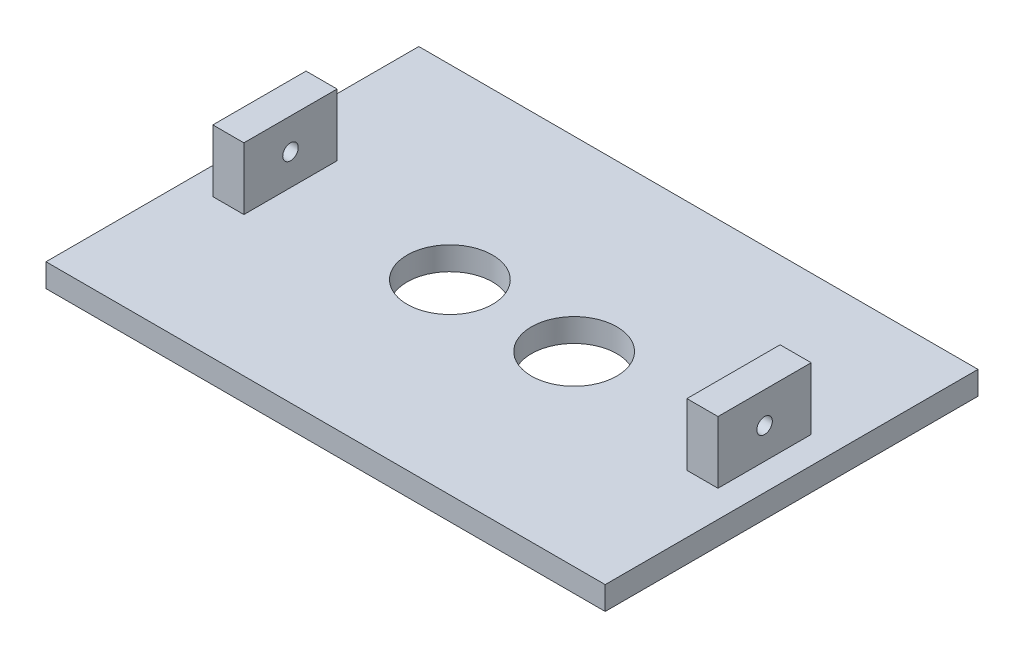
ISO-10303-21;
HEADER;
FILE_DESCRIPTION(('STEP AP214'),'2;1');
FILE_NAME('part.step','',(''),(''),'','','');
FILE_SCHEMA(('AUTOMOTIVE_DESIGN { 1 0 10303 214 1 1 1 1 }'));
ENDSEC;
DATA;
#1=APPLICATION_CONTEXT('core data for automotive mechanical design processes');
#2=APPLICATION_PROTOCOL_DEFINITION('international standard','automotive_design',2000,#1);
#3=PRODUCT_CONTEXT('',#1,'mechanical');
#4=PRODUCT('Part','Part','',(#3));
#5=PRODUCT_RELATED_PRODUCT_CATEGORY('part','',(#4));
#6=PRODUCT_DEFINITION_FORMATION('','',#4);
#7=PRODUCT_DEFINITION_CONTEXT('part definition',#1,'design');
#8=PRODUCT_DEFINITION('design','',#6,#7);
#9=PRODUCT_DEFINITION_SHAPE('','',#8);
#10=(LENGTH_UNIT() NAMED_UNIT(*) SI_UNIT(.MILLI.,.METRE.));
#11=(NAMED_UNIT(*) PLANE_ANGLE_UNIT() SI_UNIT($,.RADIAN.));
#12=(NAMED_UNIT(*) SI_UNIT($,.STERADIAN.) SOLID_ANGLE_UNIT());
#13=UNCERTAINTY_MEASURE_WITH_UNIT(LENGTH_MEASURE(1.E-05),#10,'distance_accuracy_value','');
#14=(GEOMETRIC_REPRESENTATION_CONTEXT(3) GLOBAL_UNCERTAINTY_ASSIGNED_CONTEXT((#13)) GLOBAL_UNIT_ASSIGNED_CONTEXT((#10,
#11,#12)) REPRESENTATION_CONTEXT('',''));
#15=CARTESIAN_POINT('',(0.,0.,0.));
#16=DIRECTION('',(0.,0.,1.));
#17=DIRECTION('',(1.,0.,0.));
#18=AXIS2_PLACEMENT_3D('',#15,#16,#17);
#19=CARTESIAN_POINT('',(0.,4.7625,0.));
#20=DIRECTION('',(0.,1.,0.));
#21=DIRECTION('',(0.,0.,1.));
#22=AXIS2_PLACEMENT_3D('',#19,#20,#21);
#23=PLANE('',#22);
#24=CARTESIAN_POINT('',(12.7,4.7625,0.));
#25=DIRECTION('',(0.,1.,0.));
#26=DIRECTION('',(0.,0.,1.));
#27=AXIS2_PLACEMENT_3D('',#24,#25,#26);
#28=CIRCLE('',#27,8.73125);
#29=CARTESIAN_POINT('',(12.7,4.7625,8.73125));
#30=VERTEX_POINT('',#29);
#31=EDGE_CURVE('E390',#30,#30,#28,.T.);
#32=ORIENTED_EDGE('',*,*,#31,.F.);
#33=EDGE_LOOP('',(#32));
#34=FACE_BOUND('',#33,.T.);
#35=CARTESIAN_POINT('',(-12.7,4.7625,0.));
#36=DIRECTION('',(0.,1.,0.));
#37=DIRECTION('',(0.,0.,1.));
#38=AXIS2_PLACEMENT_3D('',#35,#36,#37);
#39=CIRCLE('',#38,8.73125);
#40=CARTESIAN_POINT('',(-12.7,4.7625,8.73125));
#41=VERTEX_POINT('',#40);
#42=EDGE_CURVE('E394',#41,#41,#39,.T.);
#43=ORIENTED_EDGE('',*,*,#42,.F.);
#44=EDGE_LOOP('',(#43));
#45=FACE_BOUND('',#44,.T.);
#46=DIRECTION('',(0.,0.,-1.));
#47=VECTOR('',#46,1.);
#48=CARTESIAN_POINT('',(57.15,4.7625,-38.1));
#49=LINE('',#48,#47);
#50=CARTESIAN_POINT('',(57.15,4.7625,38.1));
#51=VERTEX_POINT('',#50);
#52=CARTESIAN_POINT('',(57.15,4.7625,-38.1));
#53=VERTEX_POINT('',#52);
#54=EDGE_CURVE('E185',#51,#53,#49,.T.);
#55=ORIENTED_EDGE('',*,*,#54,.T.);
#56=DIRECTION('',(-1.,0.,0.));
#57=VECTOR('',#56,1.);
#58=CARTESIAN_POINT('',(-57.15,4.7625,-38.1));
#59=LINE('',#58,#57);
#60=CARTESIAN_POINT('',(-57.15,4.7625,-38.1));
#61=VERTEX_POINT('',#60);
#62=EDGE_CURVE('E188',#53,#61,#59,.T.);
#63=ORIENTED_EDGE('',*,*,#62,.T.);
#64=DIRECTION('',(0.,0.,1.));
#65=VECTOR('',#64,1.);
#66=CARTESIAN_POINT('',(-57.15,4.7625,-38.1));
#67=LINE('',#66,#65);
#68=CARTESIAN_POINT('',(-57.15,4.7625,38.1));
#69=VERTEX_POINT('',#68);
#70=EDGE_CURVE('E191',#61,#69,#67,.T.);
#71=ORIENTED_EDGE('',*,*,#70,.T.);
#72=DIRECTION('',(1.,0.,0.));
#73=VECTOR('',#72,1.);
#74=CARTESIAN_POINT('',(-57.15,4.7625,38.1));
#75=LINE('',#74,#73);
#76=EDGE_CURVE('E193',#69,#51,#75,.T.);
#77=ORIENTED_EDGE('',*,*,#76,.T.);
#78=EDGE_LOOP('',(#55,#63,#71,#77));
#79=FACE_BOUND('',#78,.T.);
#80=DIRECTION('',(1.,0.,0.));
#81=VECTOR('',#80,1.);
#82=CARTESIAN_POINT('',(-45.2755,4.7625,9.52500000000001));
#83=LINE('',#82,#81);
#84=CARTESIAN_POINT('',(-51.6255,4.7625,9.52500000000001));
#85=VERTEX_POINT('',#84);
#86=CARTESIAN_POINT('',(-45.2755,4.7625,9.52500000000001));
#87=VERTEX_POINT('',#86);
#88=EDGE_CURVE('E156',#85,#87,#83,.T.);
#89=ORIENTED_EDGE('',*,*,#88,.F.);
#90=DIRECTION('',(0.,0.,1.));
#91=VECTOR('',#90,1.);
#92=CARTESIAN_POINT('',(-51.6255,4.7625,9.52500000000001));
#93=LINE('',#92,#91);
#94=CARTESIAN_POINT('',(-51.6255,4.7625,-9.52499999999999));
#95=VERTEX_POINT('',#94);
#96=EDGE_CURVE('E153',#95,#85,#93,.T.);
#97=ORIENTED_EDGE('',*,*,#96,.F.);
#98=DIRECTION('',(-1.,0.,0.));
#99=VECTOR('',#98,1.);
#100=CARTESIAN_POINT('',(-45.2755,4.7625,-9.52499999999999));
#101=LINE('',#100,#99);
#102=CARTESIAN_POINT('',(-45.2755,4.7625,-9.52499999999999));
#103=VERTEX_POINT('',#102);
#104=EDGE_CURVE('E165',#103,#95,#101,.T.);
#105=ORIENTED_EDGE('',*,*,#104,.F.);
#106=DIRECTION('',(0.,0.,-1.));
#107=VECTOR('',#106,1.);
#108=CARTESIAN_POINT('',(-45.2755,4.7625,9.52500000000001));
#109=LINE('',#108,#107);
#110=EDGE_CURVE('E173',#87,#103,#109,.T.);
#111=ORIENTED_EDGE('',*,*,#110,.F.);
#112=EDGE_LOOP('',(#89,#97,#105,#111));
#113=FACE_BOUND('',#112,.T.);
#114=DIRECTION('',(1.,0.,0.));
#115=VECTOR('',#114,1.);
#116=CARTESIAN_POINT('',(45.2755,4.7625,9.52500000000001));
#117=LINE('',#116,#115);
#118=CARTESIAN_POINT('',(45.2755,4.7625,9.52500000000001));
#119=VERTEX_POINT('',#118);
#120=CARTESIAN_POINT('',(51.6255,4.7625,9.52500000000001));
#121=VERTEX_POINT('',#120);
#122=EDGE_CURVE('E416',#119,#121,#117,.T.);
#123=ORIENTED_EDGE('',*,*,#122,.F.);
#124=DIRECTION('',(0.,0.,1.));
#125=VECTOR('',#124,1.);
#126=CARTESIAN_POINT('',(45.2755,4.7625,9.52500000000001));
#127=LINE('',#126,#125);
#128=CARTESIAN_POINT('',(45.2755,4.7625,-9.52499999999999));
#129=VERTEX_POINT('',#128);
#130=EDGE_CURVE('E151',#129,#119,#127,.T.);
#131=ORIENTED_EDGE('',*,*,#130,.F.);
#132=DIRECTION('',(-1.,0.,0.));
#133=VECTOR('',#132,1.);
#134=CARTESIAN_POINT('',(45.2755,4.7625,-9.52499999999999));
#135=LINE('',#134,#133);
#136=CARTESIAN_POINT('',(51.6255,4.7625,-9.52499999999999));
#137=VERTEX_POINT('',#136);
#138=EDGE_CURVE('E147',#137,#129,#135,.T.);
#139=ORIENTED_EDGE('',*,*,#138,.F.);
#140=DIRECTION('',(0.,0.,-1.));
#141=VECTOR('',#140,1.);
#142=CARTESIAN_POINT('',(51.6255,4.7625,9.52500000000001));
#143=LINE('',#142,#141);
#144=EDGE_CURVE('E418',#121,#137,#143,.T.);
#145=ORIENTED_EDGE('',*,*,#144,.F.);
#146=EDGE_LOOP('',(#123,#131,#139,#145));
#147=FACE_BOUND('',#146,.T.);
#148=ADVANCED_FACE('F37',(#34,#45,#79,#113,#147),#23,.T.);
#149=CARTESIAN_POINT('',(57.15,4.7625,-38.1));
#150=DIRECTION('',(-1.,0.,0.));
#151=DIRECTION('',(0.,0.,1.));
#152=AXIS2_PLACEMENT_3D('',#149,#150,#151);
#153=PLANE('',#152);
#154=DIRECTION('',(0.,0.,-1.));
#155=VECTOR('',#154,1.);
#156=CARTESIAN_POINT('',(57.15,0.,-38.1));
#157=LINE('',#156,#155);
#158=CARTESIAN_POINT('',(57.15,0.,38.1));
#159=VERTEX_POINT('',#158);
#160=CARTESIAN_POINT('',(57.15,0.,-38.1));
#161=VERTEX_POINT('',#160);
#162=EDGE_CURVE('E184',#159,#161,#157,.T.);
#163=ORIENTED_EDGE('',*,*,#162,.T.);
#164=DIRECTION('',(0.,-1.,0.));
#165=VECTOR('',#164,1.);
#166=CARTESIAN_POINT('',(57.15,4.7625,-38.1));
#167=LINE('',#166,#165);
#168=EDGE_CURVE('E11',#53,#161,#167,.T.);
#169=ORIENTED_EDGE('',*,*,#168,.F.);
#170=ORIENTED_EDGE('',*,*,#54,.F.);
#171=DIRECTION('',(0.,-1.,0.));
#172=VECTOR('',#171,1.);
#173=CARTESIAN_POINT('',(57.15,4.7625,38.1));
#174=LINE('',#173,#172);
#175=EDGE_CURVE('E195',#51,#159,#174,.T.);
#176=ORIENTED_EDGE('',*,*,#175,.T.);
#177=EDGE_LOOP('',(#163,#169,#170,#176));
#178=FACE_BOUND('',#177,.T.);
#179=ADVANCED_FACE('F39',(#178),#153,.F.);
#180=CARTESIAN_POINT('',(-57.15,4.7625,-38.1));
#181=DIRECTION('',(0.,0.,1.));
#182=DIRECTION('',(1.,0.,0.));
#183=AXIS2_PLACEMENT_3D('',#180,#181,#182);
#184=PLANE('',#183);
#185=DIRECTION('',(-1.,0.,0.));
#186=VECTOR('',#185,1.);
#187=CARTESIAN_POINT('',(-57.15,0.,-38.1));
#188=LINE('',#187,#186);
#189=CARTESIAN_POINT('',(-57.15,0.,-38.1));
#190=VERTEX_POINT('',#189);
#191=EDGE_CURVE('E198',#161,#190,#188,.T.);
#192=ORIENTED_EDGE('',*,*,#191,.T.);
#193=DIRECTION('',(0.,-1.,0.));
#194=VECTOR('',#193,1.);
#195=CARTESIAN_POINT('',(-57.15,4.7625,-38.1));
#196=LINE('',#195,#194);
#197=EDGE_CURVE('E46',#61,#190,#196,.T.);
#198=ORIENTED_EDGE('',*,*,#197,.F.);
#199=ORIENTED_EDGE('',*,*,#62,.F.);
#200=ORIENTED_EDGE('',*,*,#168,.T.);
#201=EDGE_LOOP('',(#192,#198,#199,#200));
#202=FACE_BOUND('',#201,.T.);
#203=ADVANCED_FACE('F229',(#202),#184,.F.);
#204=CARTESIAN_POINT('',(-57.15,4.7625,-38.1));
#205=DIRECTION('',(1.,0.,0.));
#206=DIRECTION('',(0.,0.,-1.));
#207=AXIS2_PLACEMENT_3D('',#204,#205,#206);
#208=PLANE('',#207);
#209=DIRECTION('',(0.,0.,1.));
#210=VECTOR('',#209,1.);
#211=CARTESIAN_POINT('',(-57.15,0.,-38.1));
#212=LINE('',#211,#210);
#213=CARTESIAN_POINT('',(-57.15,0.,38.1));
#214=VERTEX_POINT('',#213);
#215=EDGE_CURVE('E200',#190,#214,#212,.T.);
#216=ORIENTED_EDGE('',*,*,#215,.T.);
#217=DIRECTION('',(0.,-1.,0.));
#218=VECTOR('',#217,1.);
#219=CARTESIAN_POINT('',(-57.15,4.7625,38.1));
#220=LINE('',#219,#218);
#221=EDGE_CURVE('E205',#69,#214,#220,.T.);
#222=ORIENTED_EDGE('',*,*,#221,.F.);
#223=ORIENTED_EDGE('',*,*,#70,.F.);
#224=ORIENTED_EDGE('',*,*,#197,.T.);
#225=EDGE_LOOP('',(#216,#222,#223,#224));
#226=FACE_BOUND('',#225,.T.);
#227=ADVANCED_FACE('F213',(#226),#208,.F.);
#228=CARTESIAN_POINT('',(-57.15,4.7625,38.1));
#229=DIRECTION('',(0.,0.,-1.));
#230=DIRECTION('',(-1.,0.,0.));
#231=AXIS2_PLACEMENT_3D('',#228,#229,#230);
#232=PLANE('',#231);
#233=DIRECTION('',(1.,0.,0.));
#234=VECTOR('',#233,1.);
#235=CARTESIAN_POINT('',(-57.15,0.,38.1));
#236=LINE('',#235,#234);
#237=EDGE_CURVE('E189',#214,#159,#236,.T.);
#238=ORIENTED_EDGE('',*,*,#237,.T.);
#239=ORIENTED_EDGE('',*,*,#175,.F.);
#240=ORIENTED_EDGE('',*,*,#76,.F.);
#241=ORIENTED_EDGE('',*,*,#221,.T.);
#242=EDGE_LOOP('',(#238,#239,#240,#241));
#243=FACE_BOUND('',#242,.T.);
#244=ADVANCED_FACE('F222',(#243),#232,.F.);
#245=CARTESIAN_POINT('',(0.,0.,0.));
#246=DIRECTION('',(0.,1.,0.));
#247=DIRECTION('',(0.,0.,1.));
#248=AXIS2_PLACEMENT_3D('',#245,#246,#247);
#249=PLANE('',#248);
#250=CARTESIAN_POINT('',(12.7,0.,0.));
#251=DIRECTION('',(0.,-1.,0.));
#252=DIRECTION('',(0.,0.,-1.));
#253=AXIS2_PLACEMENT_3D('',#250,#251,#252);
#254=CIRCLE('',#253,8.73125);
#255=CARTESIAN_POINT('',(12.7,0.,-8.73125));
#256=VERTEX_POINT('',#255);
#257=EDGE_CURVE('E393',#256,#256,#254,.T.);
#258=ORIENTED_EDGE('',*,*,#257,.F.);
#259=EDGE_LOOP('',(#258));
#260=FACE_BOUND('',#259,.T.);
#261=CARTESIAN_POINT('',(-12.7,0.,0.));
#262=DIRECTION('',(0.,-1.,0.));
#263=DIRECTION('',(0.,0.,1.));
#264=AXIS2_PLACEMENT_3D('',#261,#262,#263);
#265=CIRCLE('',#264,8.73125);
#266=CARTESIAN_POINT('',(-12.7,0.,8.73125));
#267=VERTEX_POINT('',#266);
#268=EDGE_CURVE('E395',#267,#267,#265,.T.);
#269=ORIENTED_EDGE('',*,*,#268,.F.);
#270=EDGE_LOOP('',(#269));
#271=FACE_BOUND('',#270,.T.);
#272=ORIENTED_EDGE('',*,*,#162,.F.);
#273=ORIENTED_EDGE('',*,*,#237,.F.);
#274=ORIENTED_EDGE('',*,*,#215,.F.);
#275=ORIENTED_EDGE('',*,*,#191,.F.);
#276=EDGE_LOOP('',(#272,#273,#274,#275));
#277=FACE_BOUND('',#276,.T.);
#278=ADVANCED_FACE('F219',(#260,#271,#277),#249,.F.);
#279=CARTESIAN_POINT('',(-51.6255,17.4625,9.52500000000001));
#280=DIRECTION('',(1.,0.,0.));
#281=DIRECTION('',(0.,0.,-1.));
#282=AXIS2_PLACEMENT_3D('',#279,#280,#281);
#283=PLANE('',#282);
#284=CARTESIAN_POINT('',(-51.6255,11.1125,0.));
#285=DIRECTION('',(1.,0.,0.));
#286=DIRECTION('',(0.,0.,-1.));
#287=AXIS2_PLACEMENT_3D('',#284,#285,#286);
#288=CIRCLE('',#287,1.5875);
#289=CARTESIAN_POINT('',(-51.6255,11.1125,-1.5875));
#290=VERTEX_POINT('',#289);
#291=EDGE_CURVE('E409',#290,#290,#288,.T.);
#292=ORIENTED_EDGE('',*,*,#291,.T.);
#293=EDGE_LOOP('',(#292));
#294=FACE_BOUND('',#293,.T.);
#295=ORIENTED_EDGE('',*,*,#96,.T.);
#296=DIRECTION('',(0.,-1.,0.));
#297=VECTOR('',#296,1.);
#298=CARTESIAN_POINT('',(-51.6255,17.4625,9.52500000000001));
#299=LINE('',#298,#297);
#300=CARTESIAN_POINT('',(-51.6255,17.4625,9.52500000000001));
#301=VERTEX_POINT('',#300);
#302=EDGE_CURVE('E182',#301,#85,#299,.T.);
#303=ORIENTED_EDGE('',*,*,#302,.F.);
#304=DIRECTION('',(0.,0.,1.));
#305=VECTOR('',#304,1.);
#306=CARTESIAN_POINT('',(-51.6255,17.4625,9.52500000000001));
#307=LINE('',#306,#305);
#308=CARTESIAN_POINT('',(-51.6255,17.4625,-9.52499999999999));
#309=VERTEX_POINT('',#308);
#310=EDGE_CURVE('E161',#309,#301,#307,.T.);
#311=ORIENTED_EDGE('',*,*,#310,.F.);
#312=DIRECTION('',(0.,-1.,0.));
#313=VECTOR('',#312,1.);
#314=CARTESIAN_POINT('',(-51.6255,17.4625,-9.52499999999999));
#315=LINE('',#314,#313);
#316=EDGE_CURVE('E170',#309,#95,#315,.T.);
#317=ORIENTED_EDGE('',*,*,#316,.T.);
#318=EDGE_LOOP('',(#295,#303,#311,#317));
#319=FACE_BOUND('',#318,.T.);
#320=ADVANCED_FACE('F247',(#294,#319),#283,.F.);
#321=CARTESIAN_POINT('',(-45.2755,17.4625,9.52500000000001));
#322=DIRECTION('',(0.,0.,-1.));
#323=DIRECTION('',(-1.,0.,0.));
#324=AXIS2_PLACEMENT_3D('',#321,#322,#323);
#325=PLANE('',#324);
#326=ORIENTED_EDGE('',*,*,#88,.T.);
#327=DIRECTION('',(0.,-1.,0.));
#328=VECTOR('',#327,1.);
#329=CARTESIAN_POINT('',(-45.2755,17.4625,9.52500000000001));
#330=LINE('',#329,#328);
#331=CARTESIAN_POINT('',(-45.2755,17.4625,9.52500000000001));
#332=VERTEX_POINT('',#331);
#333=EDGE_CURVE('E179',#332,#87,#330,.T.);
#334=ORIENTED_EDGE('',*,*,#333,.F.);
#335=DIRECTION('',(1.,0.,0.));
#336=VECTOR('',#335,1.);
#337=CARTESIAN_POINT('',(-45.2755,17.4625,9.52500000000001));
#338=LINE('',#337,#336);
#339=EDGE_CURVE('E164',#301,#332,#338,.T.);
#340=ORIENTED_EDGE('',*,*,#339,.F.);
#341=ORIENTED_EDGE('',*,*,#302,.T.);
#342=EDGE_LOOP('',(#326,#334,#340,#341));
#343=FACE_BOUND('',#342,.T.);
#344=ADVANCED_FACE('F275',(#343),#325,.F.);
#345=CARTESIAN_POINT('',(-45.2755,17.4625,9.52500000000001));
#346=DIRECTION('',(-1.,0.,0.));
#347=DIRECTION('',(0.,0.,1.));
#348=AXIS2_PLACEMENT_3D('',#345,#346,#347);
#349=PLANE('',#348);
#350=CARTESIAN_POINT('',(-45.2755,11.1125,0.));
#351=DIRECTION('',(-1.,0.,0.));
#352=DIRECTION('',(0.,0.,1.));
#353=AXIS2_PLACEMENT_3D('',#350,#351,#352);
#354=CIRCLE('',#353,1.5875);
#355=CARTESIAN_POINT('',(-45.2755,11.1125,1.5875));
#356=VERTEX_POINT('',#355);
#357=EDGE_CURVE('E406',#356,#356,#354,.T.);
#358=ORIENTED_EDGE('',*,*,#357,.T.);
#359=EDGE_LOOP('',(#358));
#360=FACE_BOUND('',#359,.T.);
#361=ORIENTED_EDGE('',*,*,#110,.T.);
#362=DIRECTION('',(0.,-1.,0.));
#363=VECTOR('',#362,1.);
#364=CARTESIAN_POINT('',(-45.2755,17.4625,-9.52499999999999));
#365=LINE('',#364,#363);
#366=CARTESIAN_POINT('',(-45.2755,17.4625,-9.52499999999999));
#367=VERTEX_POINT('',#366);
#368=EDGE_CURVE('E61',#367,#103,#365,.T.);
#369=ORIENTED_EDGE('',*,*,#368,.F.);
#370=DIRECTION('',(0.,0.,-1.));
#371=VECTOR('',#370,1.);
#372=CARTESIAN_POINT('',(-45.2755,17.4625,9.52500000000001));
#373=LINE('',#372,#371);
#374=EDGE_CURVE('E167',#332,#367,#373,.T.);
#375=ORIENTED_EDGE('',*,*,#374,.F.);
#376=ORIENTED_EDGE('',*,*,#333,.T.);
#377=EDGE_LOOP('',(#361,#369,#375,#376));
#378=FACE_BOUND('',#377,.T.);
#379=ADVANCED_FACE('F285',(#360,#378),#349,.F.);
#380=CARTESIAN_POINT('',(-45.2755,17.4625,-9.52499999999999));
#381=DIRECTION('',(0.,0.,1.));
#382=DIRECTION('',(1.,0.,0.));
#383=AXIS2_PLACEMENT_3D('',#380,#381,#382);
#384=PLANE('',#383);
#385=ORIENTED_EDGE('',*,*,#104,.T.);
#386=ORIENTED_EDGE('',*,*,#316,.F.);
#387=DIRECTION('',(-1.,0.,0.));
#388=VECTOR('',#387,1.);
#389=CARTESIAN_POINT('',(-45.2755,17.4625,-9.52499999999999));
#390=LINE('',#389,#388);
#391=EDGE_CURVE('E169',#367,#309,#390,.T.);
#392=ORIENTED_EDGE('',*,*,#391,.F.);
#393=ORIENTED_EDGE('',*,*,#368,.T.);
#394=EDGE_LOOP('',(#385,#386,#392,#393));
#395=FACE_BOUND('',#394,.T.);
#396=ADVANCED_FACE('F292',(#395),#384,.F.);
#397=CARTESIAN_POINT('',(0.,17.4625,0.));
#398=DIRECTION('',(0.,1.,0.));
#399=DIRECTION('',(0.,0.,1.));
#400=AXIS2_PLACEMENT_3D('',#397,#398,#399);
#401=PLANE('',#400);
#402=ORIENTED_EDGE('',*,*,#310,.T.);
#403=ORIENTED_EDGE('',*,*,#339,.T.);
#404=ORIENTED_EDGE('',*,*,#374,.T.);
#405=ORIENTED_EDGE('',*,*,#391,.T.);
#406=EDGE_LOOP('',(#402,#403,#404,#405));
#407=FACE_BOUND('',#406,.T.);
#408=ADVANCED_FACE('F302',(#407),#401,.T.);
#409=CARTESIAN_POINT('',(45.2755,17.4625,9.52500000000001));
#410=DIRECTION('',(1.,0.,0.));
#411=DIRECTION('',(0.,0.,-1.));
#412=AXIS2_PLACEMENT_3D('',#409,#410,#411);
#413=PLANE('',#412);
#414=CARTESIAN_POINT('',(45.2755,11.1125,0.));
#415=DIRECTION('',(1.,0.,0.));
#416=DIRECTION('',(0.,0.,-1.));
#417=AXIS2_PLACEMENT_3D('',#414,#415,#416);
#418=CIRCLE('',#417,1.5875);
#419=CARTESIAN_POINT('',(45.2755,11.1125,-1.5875));
#420=VERTEX_POINT('',#419);
#421=EDGE_CURVE('E403',#420,#420,#418,.T.);
#422=ORIENTED_EDGE('',*,*,#421,.T.);
#423=EDGE_LOOP('',(#422));
#424=FACE_BOUND('',#423,.T.);
#425=ORIENTED_EDGE('',*,*,#130,.T.);
#426=DIRECTION('',(0.,-1.,0.));
#427=VECTOR('',#426,1.);
#428=CARTESIAN_POINT('',(45.2755,17.4625,9.52500000000001));
#429=LINE('',#428,#427);
#430=CARTESIAN_POINT('',(45.2755,17.4625,9.52500000000001));
#431=VERTEX_POINT('',#430);
#432=EDGE_CURVE('E132',#431,#119,#429,.T.);
#433=ORIENTED_EDGE('',*,*,#432,.F.);
#434=DIRECTION('',(0.,0.,1.));
#435=VECTOR('',#434,1.);
#436=CARTESIAN_POINT('',(45.2755,17.4625,9.52500000000001));
#437=LINE('',#436,#435);
#438=CARTESIAN_POINT('',(45.2755,17.4625,-9.52499999999999));
#439=VERTEX_POINT('',#438);
#440=EDGE_CURVE('E139',#439,#431,#437,.T.);
#441=ORIENTED_EDGE('',*,*,#440,.F.);
#442=DIRECTION('',(0.,-1.,0.));
#443=VECTOR('',#442,1.);
#444=CARTESIAN_POINT('',(45.2755,17.4625,-9.52499999999999));
#445=LINE('',#444,#443);
#446=EDGE_CURVE('E414',#439,#129,#445,.T.);
#447=ORIENTED_EDGE('',*,*,#446,.T.);
#448=EDGE_LOOP('',(#425,#433,#441,#447));
#449=FACE_BOUND('',#448,.T.);
#450=ADVANCED_FACE('F149',(#424,#449),#413,.F.);
#451=CARTESIAN_POINT('',(45.2755,17.4625,9.52500000000001));
#452=DIRECTION('',(0.,0.,-1.));
#453=DIRECTION('',(-1.,0.,0.));
#454=AXIS2_PLACEMENT_3D('',#451,#452,#453);
#455=PLANE('',#454);
#456=ORIENTED_EDGE('',*,*,#122,.T.);
#457=DIRECTION('',(0.,-1.,0.));
#458=VECTOR('',#457,1.);
#459=CARTESIAN_POINT('',(51.6255,17.4625,9.52500000000001));
#460=LINE('',#459,#458);
#461=CARTESIAN_POINT('',(51.6255,17.4625,9.52500000000001));
#462=VERTEX_POINT('',#461);
#463=EDGE_CURVE('E135',#462,#121,#460,.T.);
#464=ORIENTED_EDGE('',*,*,#463,.F.);
#465=DIRECTION('',(1.,0.,0.));
#466=VECTOR('',#465,1.);
#467=CARTESIAN_POINT('',(45.2755,17.4625,9.52500000000001));
#468=LINE('',#467,#466);
#469=EDGE_CURVE('E128',#431,#462,#468,.T.);
#470=ORIENTED_EDGE('',*,*,#469,.F.);
#471=ORIENTED_EDGE('',*,*,#432,.T.);
#472=EDGE_LOOP('',(#456,#464,#470,#471));
#473=FACE_BOUND('',#472,.T.);
#474=ADVANCED_FACE('F130',(#473),#455,.F.);
#475=CARTESIAN_POINT('',(51.6255,17.4625,9.52500000000001));
#476=DIRECTION('',(-1.,0.,0.));
#477=DIRECTION('',(0.,0.,1.));
#478=AXIS2_PLACEMENT_3D('',#475,#476,#477);
#479=PLANE('',#478);
#480=CARTESIAN_POINT('',(51.6255,11.1125,0.));
#481=DIRECTION('',(-1.,0.,0.));
#482=DIRECTION('',(0.,0.,1.));
#483=AXIS2_PLACEMENT_3D('',#480,#481,#482);
#484=CIRCLE('',#483,1.5875);
#485=CARTESIAN_POINT('',(51.6255,11.1125,1.5875));
#486=VERTEX_POINT('',#485);
#487=EDGE_CURVE('E41',#486,#486,#484,.T.);
#488=ORIENTED_EDGE('',*,*,#487,.T.);
#489=EDGE_LOOP('',(#488));
#490=FACE_BOUND('',#489,.T.);
#491=ORIENTED_EDGE('',*,*,#144,.T.);
#492=DIRECTION('',(0.,-1.,0.));
#493=VECTOR('',#492,1.);
#494=CARTESIAN_POINT('',(51.6255,17.4625,-9.52499999999999));
#495=LINE('',#494,#493);
#496=CARTESIAN_POINT('',(51.6255,17.4625,-9.52499999999999));
#497=VERTEX_POINT('',#496);
#498=EDGE_CURVE('E53',#497,#137,#495,.T.);
#499=ORIENTED_EDGE('',*,*,#498,.F.);
#500=DIRECTION('',(0.,0.,-1.));
#501=VECTOR('',#500,1.);
#502=CARTESIAN_POINT('',(51.6255,17.4625,9.52500000000001));
#503=LINE('',#502,#501);
#504=EDGE_CURVE('E138',#462,#497,#503,.T.);
#505=ORIENTED_EDGE('',*,*,#504,.F.);
#506=ORIENTED_EDGE('',*,*,#463,.T.);
#507=EDGE_LOOP('',(#491,#499,#505,#506));
#508=FACE_BOUND('',#507,.T.);
#509=ADVANCED_FACE('F325',(#490,#508),#479,.F.);
#510=CARTESIAN_POINT('',(45.2755,17.4625,-9.52499999999999));
#511=DIRECTION('',(0.,0.,1.));
#512=DIRECTION('',(1.,0.,0.));
#513=AXIS2_PLACEMENT_3D('',#510,#511,#512);
#514=PLANE('',#513);
#515=ORIENTED_EDGE('',*,*,#138,.T.);
#516=ORIENTED_EDGE('',*,*,#446,.F.);
#517=DIRECTION('',(-1.,0.,0.));
#518=VECTOR('',#517,1.);
#519=CARTESIAN_POINT('',(45.2755,17.4625,-9.52499999999999));
#520=LINE('',#519,#518);
#521=EDGE_CURVE('E143',#497,#439,#520,.T.);
#522=ORIENTED_EDGE('',*,*,#521,.F.);
#523=ORIENTED_EDGE('',*,*,#498,.T.);
#524=EDGE_LOOP('',(#515,#516,#522,#523));
#525=FACE_BOUND('',#524,.T.);
#526=ADVANCED_FACE('F332',(#525),#514,.F.);
#527=CARTESIAN_POINT('',(0.,17.4625,0.));
#528=DIRECTION('',(0.,-1.,0.));
#529=DIRECTION('',(0.,0.,-1.));
#530=AXIS2_PLACEMENT_3D('',#527,#528,#529);
#531=PLANE('',#530);
#532=ORIENTED_EDGE('',*,*,#440,.T.);
#533=ORIENTED_EDGE('',*,*,#469,.T.);
#534=ORIENTED_EDGE('',*,*,#504,.T.);
#535=ORIENTED_EDGE('',*,*,#521,.T.);
#536=EDGE_LOOP('',(#532,#533,#534,#535));
#537=FACE_BOUND('',#536,.T.);
#538=ADVANCED_FACE('F142',(#537),#531,.F.);
#539=CARTESIAN_POINT('',(57.15,11.1125,0.));
#540=DIRECTION('',(-1.,0.,0.));
#541=DIRECTION('',(0.,0.,1.));
#542=AXIS2_PLACEMENT_3D('',#539,#540,#541);
#543=CYLINDRICAL_SURFACE('',#542,1.5875);
#544=ORIENTED_EDGE('',*,*,#487,.F.);
#545=EDGE_LOOP('',(#544));
#546=FACE_BOUND('',#545,.T.);
#547=ORIENTED_EDGE('',*,*,#421,.F.);
#548=EDGE_LOOP('',(#547));
#549=FACE_BOUND('',#548,.T.);
#550=ADVANCED_FACE('F346',(#546,#549),#543,.F.);
#551=ORIENTED_EDGE('',*,*,#357,.F.);
#552=EDGE_LOOP('',(#551));
#553=FACE_BOUND('',#552,.T.);
#554=ORIENTED_EDGE('',*,*,#291,.F.);
#555=EDGE_LOOP('',(#554));
#556=FACE_BOUND('',#555,.T.);
#557=ADVANCED_FACE('F352',(#553,#556),#543,.F.);
#558=CARTESIAN_POINT('',(-12.7,17.4625,0.));
#559=DIRECTION('',(0.,-1.,0.));
#560=DIRECTION('',(0.,0.,-1.));
#561=AXIS2_PLACEMENT_3D('',#558,#559,#560);
#562=CYLINDRICAL_SURFACE('',#561,8.73125);
#563=ORIENTED_EDGE('',*,*,#42,.T.);
#564=EDGE_LOOP('',(#563));
#565=FACE_BOUND('',#564,.T.);
#566=ORIENTED_EDGE('',*,*,#268,.T.);
#567=EDGE_LOOP('',(#566));
#568=FACE_BOUND('',#567,.T.);
#569=ADVANCED_FACE('F359',(#565,#568),#562,.F.);
#570=CARTESIAN_POINT('',(12.7,17.4625,0.));
#571=DIRECTION('',(0.,-1.,0.));
#572=DIRECTION('',(0.,0.,-1.));
#573=AXIS2_PLACEMENT_3D('',#570,#571,#572);
#574=CYLINDRICAL_SURFACE('',#573,8.73125);
#575=ORIENTED_EDGE('',*,*,#31,.T.);
#576=EDGE_LOOP('',(#575));
#577=FACE_BOUND('',#576,.T.);
#578=ORIENTED_EDGE('',*,*,#257,.T.);
#579=EDGE_LOOP('',(#578));
#580=FACE_BOUND('',#579,.T.);
#581=ADVANCED_FACE('F365',(#577,#580),#574,.F.);
#582=CLOSED_SHELL('',(#148,#179,#203,#227,#244,#278,#320,#344,#379,#396,#408,#450,#474,#509,
#526,#538,#550,#557,#569,#581));
#583=MANIFOLD_SOLID_BREP('B2',#582);
#584=ADVANCED_BREP_SHAPE_REPRESENTATION('',(#18,#583),#14);
#585=SHAPE_DEFINITION_REPRESENTATION(#9,#584);
ENDSEC;
END-ISO-10303-21;
